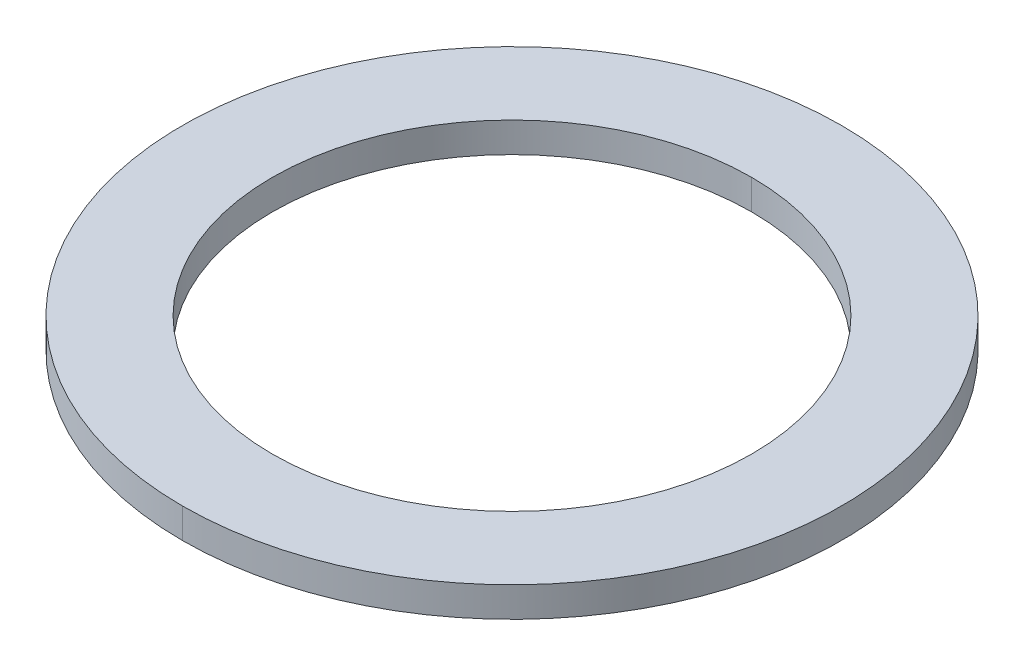
ISO-10303-21;
HEADER;
FILE_DESCRIPTION(('STEP AP214'),'2;1');
FILE_NAME('part.step','',(''),(''),'','','');
FILE_SCHEMA(('AUTOMOTIVE_DESIGN { 1 0 10303 214 1 1 1 1 }'));
ENDSEC;
DATA;
#1=APPLICATION_CONTEXT('core data for automotive mechanical design processes');
#2=APPLICATION_PROTOCOL_DEFINITION('international standard','automotive_design',2000,#1);
#3=PRODUCT_CONTEXT('',#1,'mechanical');
#4=PRODUCT('Part','Part','',(#3));
#5=PRODUCT_RELATED_PRODUCT_CATEGORY('part','',(#4));
#6=PRODUCT_DEFINITION_FORMATION('','',#4);
#7=PRODUCT_DEFINITION_CONTEXT('part definition',#1,'design');
#8=PRODUCT_DEFINITION('design','',#6,#7);
#9=PRODUCT_DEFINITION_SHAPE('','',#8);
#10=(LENGTH_UNIT() NAMED_UNIT(*) SI_UNIT(.MILLI.,.METRE.));
#11=(NAMED_UNIT(*) PLANE_ANGLE_UNIT() SI_UNIT($,.RADIAN.));
#12=(NAMED_UNIT(*) SI_UNIT($,.STERADIAN.) SOLID_ANGLE_UNIT());
#13=UNCERTAINTY_MEASURE_WITH_UNIT(LENGTH_MEASURE(1.E-05),#10,'distance_accuracy_value','');
#14=(GEOMETRIC_REPRESENTATION_CONTEXT(3) GLOBAL_UNCERTAINTY_ASSIGNED_CONTEXT((#13)) GLOBAL_UNIT_ASSIGNED_CONTEXT((#10,
#11,#12)) REPRESENTATION_CONTEXT('',''));
#15=CARTESIAN_POINT('',(0.,0.,0.));
#16=DIRECTION('',(0.,0.,1.));
#17=DIRECTION('',(1.,0.,0.));
#18=AXIS2_PLACEMENT_3D('',#15,#16,#17);
#19=CARTESIAN_POINT('',(0.,0.5,0.));
#20=DIRECTION('',(0.,-1.,0.));
#21=DIRECTION('',(0.,0.,-1.));
#22=AXIS2_PLACEMENT_3D('',#19,#20,#21);
#23=CYLINDRICAL_SURFACE('',#22,4.);
#24=DIRECTION('',(0.,-1.,0.));
#25=VECTOR('',#24,1.);
#26=CARTESIAN_POINT('',(0.,0.5,4.));
#27=LINE('',#26,#25);
#28=CARTESIAN_POINT('',(0.,0.5,4.));
#29=VERTEX_POINT('',#28);
#30=CARTESIAN_POINT('',(0.,0.,4.));
#31=VERTEX_POINT('',#30);
#32=EDGE_CURVE('E87',#29,#31,#27,.T.);
#33=ORIENTED_EDGE('',*,*,#32,.F.);
#34=CARTESIAN_POINT('',(0.,0.5,0.));
#35=DIRECTION('',(0.,1.,0.));
#36=DIRECTION('',(0.,0.,1.));
#37=AXIS2_PLACEMENT_3D('',#34,#35,#36);
#38=CIRCLE('',#37,4.);
#39=CARTESIAN_POINT('',(0.,0.5,-4.));
#40=VERTEX_POINT('',#39);
#41=EDGE_CURVE('E82',#29,#40,#38,.T.);
#42=ORIENTED_EDGE('',*,*,#41,.T.);
#43=DIRECTION('',(0.,-1.,0.));
#44=VECTOR('',#43,1.);
#45=CARTESIAN_POINT('',(0.,0.5,-4.));
#46=LINE('',#45,#44);
#47=CARTESIAN_POINT('',(0.,0.,-4.));
#48=VERTEX_POINT('',#47);
#49=EDGE_CURVE('E84',#40,#48,#46,.T.);
#50=ORIENTED_EDGE('',*,*,#49,.T.);
#51=CARTESIAN_POINT('',(0.,0.,0.));
#52=DIRECTION('',(0.,1.,0.));
#53=DIRECTION('',(0.,0.,1.));
#54=AXIS2_PLACEMENT_3D('',#51,#52,#53);
#55=CIRCLE('',#54,4.);
#56=EDGE_CURVE('E10',#31,#48,#55,.T.);
#57=ORIENTED_EDGE('',*,*,#56,.F.);
#58=EDGE_LOOP('',(#33,#42,#50,#57));
#59=FACE_BOUND('',#58,.T.);
#60=ADVANCED_FACE('F16',(#59),#23,.F.);
#61=CARTESIAN_POINT('',(0.,0.5,0.));
#62=DIRECTION('',(0.,-1.,0.));
#63=DIRECTION('',(0.,0.,-1.));
#64=AXIS2_PLACEMENT_3D('',#61,#62,#63);
#65=CYLINDRICAL_SURFACE('',#64,5.5);
#66=DIRECTION('',(0.,-1.,0.));
#67=VECTOR('',#66,1.);
#68=CARTESIAN_POINT('',(0.,0.5,5.5));
#69=LINE('',#68,#67);
#70=CARTESIAN_POINT('',(0.,0.5,5.5));
#71=VERTEX_POINT('',#70);
#72=CARTESIAN_POINT('',(0.,0.,5.5));
#73=VERTEX_POINT('',#72);
#74=EDGE_CURVE('E111',#71,#73,#69,.T.);
#75=ORIENTED_EDGE('',*,*,#74,.F.);
#76=CARTESIAN_POINT('',(0.,0.5,0.));
#77=DIRECTION('',(0.,1.,0.));
#78=DIRECTION('',(0.,0.,1.));
#79=AXIS2_PLACEMENT_3D('',#76,#77,#78);
#80=CIRCLE('',#79,5.5);
#81=CARTESIAN_POINT('',(0.,0.5,-5.5));
#82=VERTEX_POINT('',#81);
#83=EDGE_CURVE('E58',#82,#71,#80,.T.);
#84=ORIENTED_EDGE('',*,*,#83,.F.);
#85=DIRECTION('',(0.,-1.,0.));
#86=VECTOR('',#85,1.);
#87=CARTESIAN_POINT('',(0.,0.5,-5.5));
#88=LINE('',#87,#86);
#89=CARTESIAN_POINT('',(0.,0.,-5.5));
#90=VERTEX_POINT('',#89);
#91=EDGE_CURVE('E119',#82,#90,#88,.T.);
#92=ORIENTED_EDGE('',*,*,#91,.T.);
#93=CARTESIAN_POINT('',(0.,0.,0.));
#94=DIRECTION('',(0.,1.,0.));
#95=DIRECTION('',(0.,0.,1.));
#96=AXIS2_PLACEMENT_3D('',#93,#94,#95);
#97=CIRCLE('',#96,5.5);
#98=EDGE_CURVE('E19',#90,#73,#97,.T.);
#99=ORIENTED_EDGE('',*,*,#98,.T.);
#100=EDGE_LOOP('',(#75,#84,#92,#99));
#101=FACE_BOUND('',#100,.T.);
#102=ADVANCED_FACE('F155',(#101),#65,.T.);
#103=CARTESIAN_POINT('',(0.,0.,0.));
#104=DIRECTION('',(0.,1.,0.));
#105=DIRECTION('',(1.,0.,0.));
#106=AXIS2_PLACEMENT_3D('',#103,#104,#105);
#107=PLANE('',#106);
#108=CARTESIAN_POINT('',(0.,0.,0.));
#109=DIRECTION('',(0.,1.,0.));
#110=DIRECTION('',(0.,0.,1.));
#111=AXIS2_PLACEMENT_3D('',#108,#109,#110);
#112=CIRCLE('',#111,4.);
#113=EDGE_CURVE('E95',#48,#31,#112,.T.);
#114=ORIENTED_EDGE('',*,*,#113,.T.);
#115=ORIENTED_EDGE('',*,*,#56,.T.);
#116=EDGE_LOOP('',(#114,#115));
#117=FACE_BOUND('',#116,.T.);
#118=ORIENTED_EDGE('',*,*,#98,.F.);
#119=CARTESIAN_POINT('',(0.,0.,0.));
#120=DIRECTION('',(0.,1.,0.));
#121=DIRECTION('',(0.,0.,1.));
#122=AXIS2_PLACEMENT_3D('',#119,#120,#121);
#123=CIRCLE('',#122,5.5);
#124=EDGE_CURVE('E115',#73,#90,#123,.T.);
#125=ORIENTED_EDGE('',*,*,#124,.F.);
#126=EDGE_LOOP('',(#118,#125));
#127=FACE_BOUND('',#126,.T.);
#128=ADVANCED_FACE('F159',(#117,#127),#107,.F.);
#129=CARTESIAN_POINT('',(0.,0.5,0.));
#130=DIRECTION('',(0.,1.,0.));
#131=DIRECTION('',(1.,0.,0.));
#132=AXIS2_PLACEMENT_3D('',#129,#130,#131);
#133=PLANE('',#132);
#134=CARTESIAN_POINT('',(0.,0.5,0.));
#135=DIRECTION('',(0.,1.,0.));
#136=DIRECTION('',(0.,0.,1.));
#137=AXIS2_PLACEMENT_3D('',#134,#135,#136);
#138=CIRCLE('',#137,4.);
#139=EDGE_CURVE('E94',#40,#29,#138,.T.);
#140=ORIENTED_EDGE('',*,*,#139,.F.);
#141=ORIENTED_EDGE('',*,*,#41,.F.);
#142=EDGE_LOOP('',(#140,#141));
#143=FACE_BOUND('',#142,.T.);
#144=ORIENTED_EDGE('',*,*,#83,.T.);
#145=CARTESIAN_POINT('',(0.,0.5,0.));
#146=DIRECTION('',(0.,1.,0.));
#147=DIRECTION('',(0.,0.,1.));
#148=AXIS2_PLACEMENT_3D('',#145,#146,#147);
#149=CIRCLE('',#148,5.5);
#150=EDGE_CURVE('E97',#71,#82,#149,.T.);
#151=ORIENTED_EDGE('',*,*,#150,.T.);
#152=EDGE_LOOP('',(#144,#151));
#153=FACE_BOUND('',#152,.T.);
#154=ADVANCED_FACE('F99',(#143,#153),#133,.T.);
#155=CARTESIAN_POINT('',(0.,0.5,0.));
#156=DIRECTION('',(0.,-1.,0.));
#157=DIRECTION('',(0.,0.,-1.));
#158=AXIS2_PLACEMENT_3D('',#155,#156,#157);
#159=CYLINDRICAL_SURFACE('',#158,5.5);
#160=ORIENTED_EDGE('',*,*,#150,.F.);
#161=ORIENTED_EDGE('',*,*,#74,.T.);
#162=ORIENTED_EDGE('',*,*,#124,.T.);
#163=ORIENTED_EDGE('',*,*,#91,.F.);
#164=EDGE_LOOP('',(#160,#161,#162,#163));
#165=FACE_BOUND('',#164,.T.);
#166=ADVANCED_FACE('F147',(#165),#159,.T.);
#167=CARTESIAN_POINT('',(0.,0.5,0.));
#168=DIRECTION('',(0.,-1.,0.));
#169=DIRECTION('',(0.,0.,-1.));
#170=AXIS2_PLACEMENT_3D('',#167,#168,#169);
#171=CYLINDRICAL_SURFACE('',#170,4.);
#172=ORIENTED_EDGE('',*,*,#139,.T.);
#173=ORIENTED_EDGE('',*,*,#32,.T.);
#174=ORIENTED_EDGE('',*,*,#113,.F.);
#175=ORIENTED_EDGE('',*,*,#49,.F.);
#176=EDGE_LOOP('',(#172,#173,#174,#175));
#177=FACE_BOUND('',#176,.T.);
#178=ADVANCED_FACE('F93',(#177),#171,.F.);
#179=CLOSED_SHELL('',(#60,#102,#128,#154,#166,#178));
#180=MANIFOLD_SOLID_BREP('B1',#179);
#181=ADVANCED_BREP_SHAPE_REPRESENTATION('',(#18,#180),#14);
#182=SHAPE_DEFINITION_REPRESENTATION(#9,#181);
ENDSEC;
END-ISO-10303-21;
